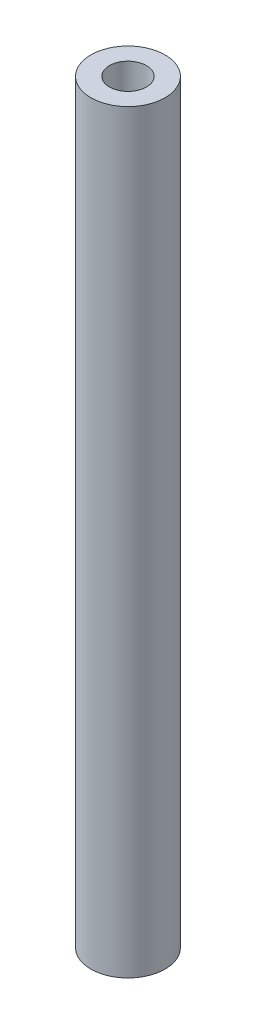
ISO-10303-21;
HEADER;
FILE_DESCRIPTION(('STEP AP214'),'2;1');
FILE_NAME('part.step','',(''),(''),'','','');
FILE_SCHEMA(('AUTOMOTIVE_DESIGN { 1 0 10303 214 1 1 1 1 }'));
ENDSEC;
DATA;
#1=APPLICATION_CONTEXT('core data for automotive mechanical design processes');
#2=APPLICATION_PROTOCOL_DEFINITION('international standard','automotive_design',2000,#1);
#3=PRODUCT_CONTEXT('',#1,'mechanical');
#4=PRODUCT('Part','Part','',(#3));
#5=PRODUCT_RELATED_PRODUCT_CATEGORY('part','',(#4));
#6=PRODUCT_DEFINITION_FORMATION('','',#4);
#7=PRODUCT_DEFINITION_CONTEXT('part definition',#1,'design');
#8=PRODUCT_DEFINITION('design','',#6,#7);
#9=PRODUCT_DEFINITION_SHAPE('','',#8);
#10=(LENGTH_UNIT() NAMED_UNIT(*) SI_UNIT(.MILLI.,.METRE.));
#11=(NAMED_UNIT(*) PLANE_ANGLE_UNIT() SI_UNIT($,.RADIAN.));
#12=(NAMED_UNIT(*) SI_UNIT($,.STERADIAN.) SOLID_ANGLE_UNIT());
#13=UNCERTAINTY_MEASURE_WITH_UNIT(LENGTH_MEASURE(1.E-05),#10,'distance_accuracy_value','');
#14=(GEOMETRIC_REPRESENTATION_CONTEXT(3) GLOBAL_UNCERTAINTY_ASSIGNED_CONTEXT((#13)) GLOBAL_UNIT_ASSIGNED_CONTEXT((#10,
#11,#12)) REPRESENTATION_CONTEXT('',''));
#15=CARTESIAN_POINT('',(0.,0.,0.));
#16=DIRECTION('',(0.,0.,1.));
#17=DIRECTION('',(1.,0.,0.));
#18=AXIS2_PLACEMENT_3D('',#15,#16,#17);
#19=CARTESIAN_POINT('',(0.,61.,0.));
#20=DIRECTION('',(0.,1.,0.));
#21=DIRECTION('',(0.,0.,1.));
#22=AXIS2_PLACEMENT_3D('',#19,#20,#21);
#23=PLANE('',#22);
#24=CARTESIAN_POINT('',(0.,61.,0.));
#25=DIRECTION('',(0.,1.,0.));
#26=DIRECTION('',(0.,0.,1.));
#27=AXIS2_PLACEMENT_3D('',#24,#25,#26);
#28=CIRCLE('',#27,3.);
#29=CARTESIAN_POINT('',(0.,61.,3.));
#30=VERTEX_POINT('',#29);
#31=EDGE_CURVE('E10',#30,#30,#28,.T.);
#32=ORIENTED_EDGE('',*,*,#31,.T.);
#33=EDGE_LOOP('',(#32));
#34=FACE_BOUND('',#33,.T.);
#35=CARTESIAN_POINT('',(0.,61.,0.));
#36=DIRECTION('',(0.,1.,0.));
#37=DIRECTION('',(0.,0.,1.));
#38=AXIS2_PLACEMENT_3D('',#35,#36,#37);
#39=CIRCLE('',#38,1.5);
#40=CARTESIAN_POINT('',(0.,61.,1.5));
#41=VERTEX_POINT('',#40);
#42=EDGE_CURVE('E42',#41,#41,#39,.T.);
#43=ORIENTED_EDGE('',*,*,#42,.F.);
#44=EDGE_LOOP('',(#43));
#45=FACE_BOUND('',#44,.T.);
#46=ADVANCED_FACE('F31',(#34,#45),#23,.T.);
#47=CARTESIAN_POINT('',(0.,0.,0.));
#48=DIRECTION('',(0.,1.,0.));
#49=DIRECTION('',(0.,0.,1.));
#50=AXIS2_PLACEMENT_3D('',#47,#48,#49);
#51=PLANE('',#50);
#52=CARTESIAN_POINT('',(0.,0.,0.));
#53=DIRECTION('',(0.,1.,0.));
#54=DIRECTION('',(0.,0.,1.));
#55=AXIS2_PLACEMENT_3D('',#52,#53,#54);
#56=CIRCLE('',#55,3.);
#57=CARTESIAN_POINT('',(0.,0.,3.));
#58=VERTEX_POINT('',#57);
#59=EDGE_CURVE('E35',#58,#58,#56,.T.);
#60=ORIENTED_EDGE('',*,*,#59,.F.);
#61=EDGE_LOOP('',(#60));
#62=FACE_BOUND('',#61,.T.);
#63=CARTESIAN_POINT('',(0.,0.,0.));
#64=DIRECTION('',(0.,1.,0.));
#65=DIRECTION('',(0.,0.,1.));
#66=AXIS2_PLACEMENT_3D('',#63,#64,#65);
#67=CIRCLE('',#66,1.5);
#68=CARTESIAN_POINT('',(0.,0.,1.5));
#69=VERTEX_POINT('',#68);
#70=EDGE_CURVE('E44',#69,#69,#67,.T.);
#71=ORIENTED_EDGE('',*,*,#70,.T.);
#72=EDGE_LOOP('',(#71));
#73=FACE_BOUND('',#72,.T.);
#74=ADVANCED_FACE('F54',(#62,#73),#51,.F.);
#75=CARTESIAN_POINT('',(0.,61.,0.));
#76=DIRECTION('',(0.,-1.,0.));
#77=DIRECTION('',(0.,0.,-1.));
#78=AXIS2_PLACEMENT_3D('',#75,#76,#77);
#79=CYLINDRICAL_SURFACE('',#78,3.);
#80=ORIENTED_EDGE('',*,*,#31,.F.);
#81=EDGE_LOOP('',(#80));
#82=FACE_BOUND('',#81,.T.);
#83=ORIENTED_EDGE('',*,*,#59,.T.);
#84=EDGE_LOOP('',(#83));
#85=FACE_BOUND('',#84,.T.);
#86=ADVANCED_FACE('F33',(#82,#85),#79,.T.);
#87=CARTESIAN_POINT('',(0.,61.,0.));
#88=DIRECTION('',(0.,-1.,0.));
#89=DIRECTION('',(0.,0.,-1.));
#90=AXIS2_PLACEMENT_3D('',#87,#88,#89);
#91=CYLINDRICAL_SURFACE('',#90,1.5);
#92=ORIENTED_EDGE('',*,*,#42,.T.);
#93=EDGE_LOOP('',(#92));
#94=FACE_BOUND('',#93,.T.);
#95=ORIENTED_EDGE('',*,*,#70,.F.);
#96=EDGE_LOOP('',(#95));
#97=FACE_BOUND('',#96,.T.);
#98=ADVANCED_FACE('F50',(#94,#97),#91,.F.);
#99=CLOSED_SHELL('',(#46,#74,#86,#98));
#100=MANIFOLD_SOLID_BREP('B2',#99);
#101=ADVANCED_BREP_SHAPE_REPRESENTATION('',(#18,#100),#14);
#102=SHAPE_DEFINITION_REPRESENTATION(#9,#101);
ENDSEC;
END-ISO-10303-21;
